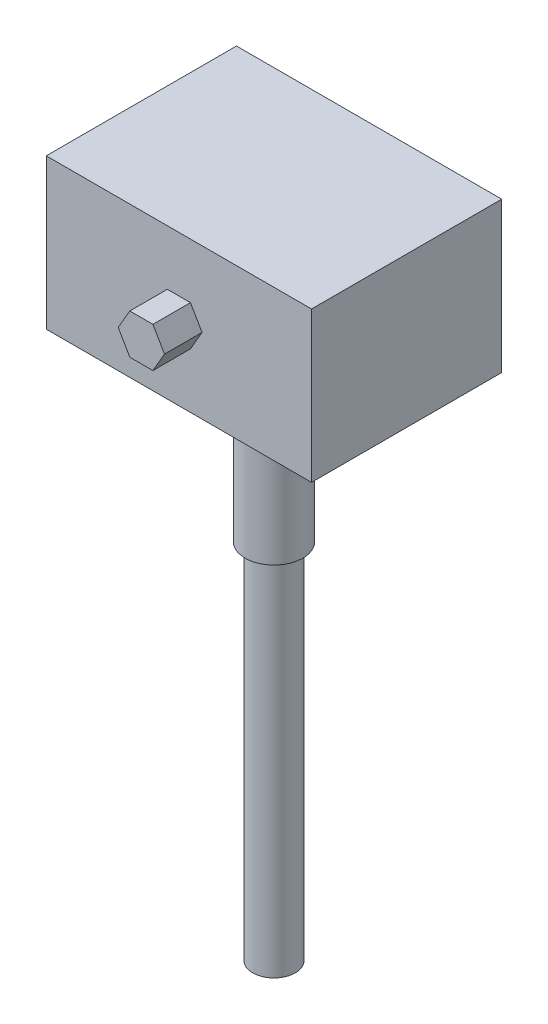
ISO-10303-21;
HEADER;
FILE_DESCRIPTION(('STEP AP214'),'2;1');
FILE_NAME('part.step','',(''),(''),'','','');
FILE_SCHEMA(('AUTOMOTIVE_DESIGN { 1 0 10303 214 1 1 1 1 }'));
ENDSEC;
DATA;
#1=APPLICATION_CONTEXT('core data for automotive mechanical design processes');
#2=APPLICATION_PROTOCOL_DEFINITION('international standard','automotive_design',2000,#1);
#3=PRODUCT_CONTEXT('',#1,'mechanical');
#4=PRODUCT('Part','Part','',(#3));
#5=PRODUCT_RELATED_PRODUCT_CATEGORY('part','',(#4));
#6=PRODUCT_DEFINITION_FORMATION('','',#4);
#7=PRODUCT_DEFINITION_CONTEXT('part definition',#1,'design');
#8=PRODUCT_DEFINITION('design','',#6,#7);
#9=PRODUCT_DEFINITION_SHAPE('','',#8);
#10=(LENGTH_UNIT() NAMED_UNIT(*) SI_UNIT(.MILLI.,.METRE.));
#11=(NAMED_UNIT(*) PLANE_ANGLE_UNIT() SI_UNIT($,.RADIAN.));
#12=(NAMED_UNIT(*) SI_UNIT($,.STERADIAN.) SOLID_ANGLE_UNIT());
#13=UNCERTAINTY_MEASURE_WITH_UNIT(LENGTH_MEASURE(1.E-05),#10,'distance_accuracy_value','');
#14=(GEOMETRIC_REPRESENTATION_CONTEXT(3) GLOBAL_UNCERTAINTY_ASSIGNED_CONTEXT((#13)) GLOBAL_UNIT_ASSIGNED_CONTEXT((#10,
#11,#12)) REPRESENTATION_CONTEXT('',''));
#15=CARTESIAN_POINT('',(0.,0.,0.));
#16=DIRECTION('',(0.,0.,1.));
#17=DIRECTION('',(1.,0.,0.));
#18=AXIS2_PLACEMENT_3D('',#15,#16,#17);
#19=CARTESIAN_POINT('',(-53.,60.,38.));
#20=DIRECTION('',(0.,0.,-1.));
#21=DIRECTION('',(-1.,0.,0.));
#22=AXIS2_PLACEMENT_3D('',#19,#20,#21);
#23=PLANE('',#22);
#24=DIRECTION('',(1.,0.,0.));
#25=VECTOR('',#24,1.);
#26=CARTESIAN_POINT('',(-53.,0.,38.));
#27=LINE('',#26,#25);
#28=CARTESIAN_POINT('',(-53.,0.,38.));
#29=VERTEX_POINT('',#28);
#30=CARTESIAN_POINT('',(53.,0.,38.));
#31=VERTEX_POINT('',#30);
#32=EDGE_CURVE('E146',#29,#31,#27,.T.);
#33=ORIENTED_EDGE('',*,*,#32,.T.);
#34=DIRECTION('',(0.,-1.,0.));
#35=VECTOR('',#34,1.);
#36=CARTESIAN_POINT('',(53.,60.,38.));
#37=LINE('',#36,#35);
#38=CARTESIAN_POINT('',(53.,60.,38.));
#39=VERTEX_POINT('',#38);
#40=EDGE_CURVE('E151',#39,#31,#37,.T.);
#41=ORIENTED_EDGE('',*,*,#40,.F.);
#42=DIRECTION('',(1.,0.,0.));
#43=VECTOR('',#42,1.);
#44=CARTESIAN_POINT('',(-53.,60.,38.));
#45=LINE('',#44,#43);
#46=CARTESIAN_POINT('',(-53.,60.,38.));
#47=VERTEX_POINT('',#46);
#48=EDGE_CURVE('E150',#47,#39,#45,.T.);
#49=ORIENTED_EDGE('',*,*,#48,.F.);
#50=DIRECTION('',(0.,-1.,0.));
#51=VECTOR('',#50,1.);
#52=CARTESIAN_POINT('',(-53.,60.,38.));
#53=LINE('',#52,#51);
#54=EDGE_CURVE('E159',#47,#29,#53,.T.);
#55=ORIENTED_EDGE('',*,*,#54,.T.);
#56=EDGE_LOOP('',(#33,#41,#49,#55));
#57=FACE_BOUND('',#56,.T.);
#58=DIRECTION('',(0.499999999999999,0.866025403784439,0.));
#59=VECTOR('',#58,1.);
#60=CARTESIAN_POINT('',(4.618802153517,22.,38.));
#61=LINE('',#60,#59);
#62=CARTESIAN_POINT('',(4.618802153517,22.,38.));
#63=VERTEX_POINT('',#62);
#64=CARTESIAN_POINT('',(9.23760430703401,30.,38.));
#65=VERTEX_POINT('',#64);
#66=EDGE_CURVE('E132',#63,#65,#61,.T.);
#67=ORIENTED_EDGE('',*,*,#66,.F.);
#68=DIRECTION('',(1.,0.,0.));
#69=VECTOR('',#68,1.);
#70=CARTESIAN_POINT('',(-4.618802153517,22.,38.));
#71=LINE('',#70,#69);
#72=CARTESIAN_POINT('',(-4.618802153517,22.,38.));
#73=VERTEX_POINT('',#72);
#74=EDGE_CURVE('E129',#73,#63,#71,.T.);
#75=ORIENTED_EDGE('',*,*,#74,.F.);
#76=DIRECTION('',(0.500000000000001,-0.866025403784438,0.));
#77=VECTOR('',#76,1.);
#78=CARTESIAN_POINT('',(-9.23760430703402,30.,38.));
#79=LINE('',#78,#77);
#80=CARTESIAN_POINT('',(-9.23760430703402,30.,38.));
#81=VERTEX_POINT('',#80);
#82=EDGE_CURVE('E193',#81,#73,#79,.T.);
#83=ORIENTED_EDGE('',*,*,#82,.F.);
#84=DIRECTION('',(-0.499999999999999,-0.866025403784439,0.));
#85=VECTOR('',#84,1.);
#86=CARTESIAN_POINT('',(-4.61880215351701,38.,38.));
#87=LINE('',#86,#85);
#88=CARTESIAN_POINT('',(-4.618802153517,38.,38.));
#89=VERTEX_POINT('',#88);
#90=EDGE_CURVE('E190',#89,#81,#87,.T.);
#91=ORIENTED_EDGE('',*,*,#90,.F.);
#92=DIRECTION('',(-1.,0.,0.));
#93=VECTOR('',#92,1.);
#94=CARTESIAN_POINT('',(4.618802153517,38.,38.));
#95=LINE('',#94,#93);
#96=CARTESIAN_POINT('',(4.618802153517,38.,38.));
#97=VERTEX_POINT('',#96);
#98=EDGE_CURVE('E55',#97,#89,#95,.T.);
#99=ORIENTED_EDGE('',*,*,#98,.F.);
#100=DIRECTION('',(-0.5,0.866025403784439,0.));
#101=VECTOR('',#100,1.);
#102=CARTESIAN_POINT('',(9.237604307034,30.,38.));
#103=LINE('',#102,#101);
#104=EDGE_CURVE('E50',#65,#97,#103,.T.);
#105=ORIENTED_EDGE('',*,*,#104,.F.);
#106=EDGE_LOOP('',(#67,#75,#83,#91,#99,#105));
#107=FACE_BOUND('',#106,.T.);
#108=ADVANCED_FACE('F33',(#57,#107),#23,.F.);
#109=CARTESIAN_POINT('',(53.,60.,-38.));
#110=DIRECTION('',(-1.,0.,0.));
#111=DIRECTION('',(0.,0.,1.));
#112=AXIS2_PLACEMENT_3D('',#109,#110,#111);
#113=PLANE('',#112);
#114=DIRECTION('',(0.,0.,-1.));
#115=VECTOR('',#114,1.);
#116=CARTESIAN_POINT('',(53.,0.,-38.));
#117=LINE('',#116,#115);
#118=CARTESIAN_POINT('',(53.,0.,-38.));
#119=VERTEX_POINT('',#118);
#120=EDGE_CURVE('E133',#31,#119,#117,.T.);
#121=ORIENTED_EDGE('',*,*,#120,.T.);
#122=DIRECTION('',(0.,-1.,0.));
#123=VECTOR('',#122,1.);
#124=CARTESIAN_POINT('',(53.,60.,-38.));
#125=LINE('',#124,#123);
#126=CARTESIAN_POINT('',(53.,60.,-38.));
#127=VERTEX_POINT('',#126);
#128=EDGE_CURVE('E37',#127,#119,#125,.T.);
#129=ORIENTED_EDGE('',*,*,#128,.F.);
#130=DIRECTION('',(0.,0.,-1.));
#131=VECTOR('',#130,1.);
#132=CARTESIAN_POINT('',(53.,60.,-38.));
#133=LINE('',#132,#131);
#134=EDGE_CURVE('E142',#39,#127,#133,.T.);
#135=ORIENTED_EDGE('',*,*,#134,.F.);
#136=ORIENTED_EDGE('',*,*,#40,.T.);
#137=EDGE_LOOP('',(#121,#129,#135,#136));
#138=FACE_BOUND('',#137,.T.);
#139=ADVANCED_FACE('F35',(#138),#113,.F.);
#140=CARTESIAN_POINT('',(-53.,60.,-38.));
#141=DIRECTION('',(0.,0.,1.));
#142=DIRECTION('',(1.,0.,0.));
#143=AXIS2_PLACEMENT_3D('',#140,#141,#142);
#144=PLANE('',#143);
#145=DIRECTION('',(-1.,0.,0.));
#146=VECTOR('',#145,1.);
#147=CARTESIAN_POINT('',(-53.,0.,-38.));
#148=LINE('',#147,#146);
#149=CARTESIAN_POINT('',(-53.,0.,-38.));
#150=VERTEX_POINT('',#149);
#151=EDGE_CURVE('E136',#119,#150,#148,.T.);
#152=ORIENTED_EDGE('',*,*,#151,.T.);
#153=DIRECTION('',(0.,-1.,0.));
#154=VECTOR('',#153,1.);
#155=CARTESIAN_POINT('',(-53.,60.,-38.));
#156=LINE('',#155,#154);
#157=CARTESIAN_POINT('',(-53.,60.,-38.));
#158=VERTEX_POINT('',#157);
#159=EDGE_CURVE('E161',#158,#150,#156,.T.);
#160=ORIENTED_EDGE('',*,*,#159,.F.);
#161=DIRECTION('',(-1.,0.,0.));
#162=VECTOR('',#161,1.);
#163=CARTESIAN_POINT('',(-53.,60.,-38.));
#164=LINE('',#163,#162);
#165=EDGE_CURVE('E145',#127,#158,#164,.T.);
#166=ORIENTED_EDGE('',*,*,#165,.F.);
#167=ORIENTED_EDGE('',*,*,#128,.T.);
#168=EDGE_LOOP('',(#152,#160,#166,#167));
#169=FACE_BOUND('',#168,.T.);
#170=ADVANCED_FACE('F224',(#169),#144,.F.);
#171=CARTESIAN_POINT('',(-53.,60.,-38.));
#172=DIRECTION('',(1.,0.,0.));
#173=DIRECTION('',(0.,0.,-1.));
#174=AXIS2_PLACEMENT_3D('',#171,#172,#173);
#175=PLANE('',#174);
#176=DIRECTION('',(0.,0.,1.));
#177=VECTOR('',#176,1.);
#178=CARTESIAN_POINT('',(-53.,0.,-38.));
#179=LINE('',#178,#177);
#180=EDGE_CURVE('E154',#150,#29,#179,.T.);
#181=ORIENTED_EDGE('',*,*,#180,.T.);
#182=ORIENTED_EDGE('',*,*,#54,.F.);
#183=DIRECTION('',(0.,0.,1.));
#184=VECTOR('',#183,1.);
#185=CARTESIAN_POINT('',(-53.,60.,-38.));
#186=LINE('',#185,#184);
#187=EDGE_CURVE('E148',#158,#47,#186,.T.);
#188=ORIENTED_EDGE('',*,*,#187,.F.);
#189=ORIENTED_EDGE('',*,*,#159,.T.);
#190=EDGE_LOOP('',(#181,#182,#188,#189));
#191=FACE_BOUND('',#190,.T.);
#192=ADVANCED_FACE('F230',(#191),#175,.F.);
#193=CARTESIAN_POINT('',(0.,60.,0.));
#194=DIRECTION('',(0.,1.,0.));
#195=DIRECTION('',(0.,0.,1.));
#196=AXIS2_PLACEMENT_3D('',#193,#194,#195);
#197=PLANE('',#196);
#198=ORIENTED_EDGE('',*,*,#134,.T.);
#199=ORIENTED_EDGE('',*,*,#165,.T.);
#200=ORIENTED_EDGE('',*,*,#187,.T.);
#201=ORIENTED_EDGE('',*,*,#48,.T.);
#202=EDGE_LOOP('',(#198,#199,#200,#201));
#203=FACE_BOUND('',#202,.T.);
#204=ADVANCED_FACE('F232',(#203),#197,.T.);
#205=CARTESIAN_POINT('',(0.,0.,0.));
#206=DIRECTION('',(0.,1.,0.));
#207=DIRECTION('',(0.,0.,1.));
#208=AXIS2_PLACEMENT_3D('',#205,#206,#207);
#209=PLANE('',#208);
#210=CARTESIAN_POINT('',(0.,0.,0.));
#211=DIRECTION('',(0.,-1.,0.));
#212=DIRECTION('',(0.,0.,-1.));
#213=AXIS2_PLACEMENT_3D('',#210,#211,#212);
#214=CIRCLE('',#213,14.);
#215=CARTESIAN_POINT('',(0.,0.,-14.));
#216=VERTEX_POINT('',#215);
#217=EDGE_CURVE('E168',#216,#216,#214,.T.);
#218=ORIENTED_EDGE('',*,*,#217,.F.);
#219=EDGE_LOOP('',(#218));
#220=FACE_BOUND('',#219,.T.);
#221=ORIENTED_EDGE('',*,*,#120,.F.);
#222=ORIENTED_EDGE('',*,*,#32,.F.);
#223=ORIENTED_EDGE('',*,*,#180,.F.);
#224=ORIENTED_EDGE('',*,*,#151,.F.);
#225=EDGE_LOOP('',(#221,#222,#223,#224));
#226=FACE_BOUND('',#225,.T.);
#227=ADVANCED_FACE('F228',(#220,#226),#209,.F.);
#228=CARTESIAN_POINT('',(4.618802153517,22.,53.));
#229=DIRECTION('',(-0.866025403784439,0.499999999999999,0.));
#230=DIRECTION('',(-0.499999999999999,-0.866025403784439,0.));
#231=AXIS2_PLACEMENT_3D('',#228,#229,#230);
#232=PLANE('',#231);
#233=ORIENTED_EDGE('',*,*,#66,.T.);
#234=DIRECTION('',(0.,0.,-1.));
#235=VECTOR('',#234,1.);
#236=CARTESIAN_POINT('',(9.237604307034,30.,53.));
#237=LINE('',#236,#235);
#238=CARTESIAN_POINT('',(9.237604307034,30.,53.));
#239=VERTEX_POINT('',#238);
#240=EDGE_CURVE('E113',#239,#65,#237,.T.);
#241=ORIENTED_EDGE('',*,*,#240,.F.);
#242=DIRECTION('',(0.499999999999999,0.866025403784439,0.));
#243=VECTOR('',#242,1.);
#244=CARTESIAN_POINT('',(4.618802153517,22.,53.));
#245=LINE('',#244,#243);
#246=CARTESIAN_POINT('',(4.618802153517,22.,53.));
#247=VERTEX_POINT('',#246);
#248=EDGE_CURVE('E120',#247,#239,#245,.T.);
#249=ORIENTED_EDGE('',*,*,#248,.F.);
#250=DIRECTION('',(0.,0.,-1.));
#251=VECTOR('',#250,1.);
#252=CARTESIAN_POINT('',(4.618802153517,22.,53.));
#253=LINE('',#252,#251);
#254=EDGE_CURVE('E186',#247,#63,#253,.T.);
#255=ORIENTED_EDGE('',*,*,#254,.T.);
#256=EDGE_LOOP('',(#233,#241,#249,#255));
#257=FACE_BOUND('',#256,.T.);
#258=ADVANCED_FACE('F131',(#257),#232,.F.);
#259=CARTESIAN_POINT('',(9.237604307034,30.,53.));
#260=DIRECTION('',(-0.866025403784439,-0.5,0.));
#261=DIRECTION('',(0.5,-0.866025403784439,0.));
#262=AXIS2_PLACEMENT_3D('',#259,#260,#261);
#263=PLANE('',#262);
#264=ORIENTED_EDGE('',*,*,#104,.T.);
#265=DIRECTION('',(0.,0.,-1.));
#266=VECTOR('',#265,1.);
#267=CARTESIAN_POINT('',(4.618802153517,38.,53.));
#268=LINE('',#267,#266);
#269=CARTESIAN_POINT('',(4.618802153517,38.,53.));
#270=VERTEX_POINT('',#269);
#271=EDGE_CURVE('E116',#270,#97,#268,.T.);
#272=ORIENTED_EDGE('',*,*,#271,.F.);
#273=DIRECTION('',(-0.5,0.866025403784439,0.));
#274=VECTOR('',#273,1.);
#275=CARTESIAN_POINT('',(9.237604307034,30.,53.));
#276=LINE('',#275,#274);
#277=EDGE_CURVE('E109',#239,#270,#276,.T.);
#278=ORIENTED_EDGE('',*,*,#277,.F.);
#279=ORIENTED_EDGE('',*,*,#240,.T.);
#280=EDGE_LOOP('',(#264,#272,#278,#279));
#281=FACE_BOUND('',#280,.T.);
#282=ADVANCED_FACE('F111',(#281),#263,.F.);
#283=CARTESIAN_POINT('',(4.618802153517,38.,53.));
#284=DIRECTION('',(0.,-1.,0.));
#285=DIRECTION('',(0.,0.,-1.));
#286=AXIS2_PLACEMENT_3D('',#283,#284,#285);
#287=PLANE('',#286);
#288=ORIENTED_EDGE('',*,*,#98,.T.);
#289=DIRECTION('',(0.,0.,-1.));
#290=VECTOR('',#289,1.);
#291=CARTESIAN_POINT('',(-4.61880215351701,38.,53.));
#292=LINE('',#291,#290);
#293=CARTESIAN_POINT('',(-4.61880215351701,38.,53.));
#294=VERTEX_POINT('',#293);
#295=EDGE_CURVE('E138',#294,#89,#292,.T.);
#296=ORIENTED_EDGE('',*,*,#295,.F.);
#297=DIRECTION('',(-1.,0.,0.));
#298=VECTOR('',#297,1.);
#299=CARTESIAN_POINT('',(4.618802153517,38.,53.));
#300=LINE('',#299,#298);
#301=EDGE_CURVE('E119',#270,#294,#300,.T.);
#302=ORIENTED_EDGE('',*,*,#301,.F.);
#303=ORIENTED_EDGE('',*,*,#271,.T.);
#304=EDGE_LOOP('',(#288,#296,#302,#303));
#305=FACE_BOUND('',#304,.T.);
#306=ADVANCED_FACE('F211',(#305),#287,.F.);
#307=CARTESIAN_POINT('',(-4.61880215351701,38.,53.));
#308=DIRECTION('',(0.866025403784439,-0.499999999999999,0.));
#309=DIRECTION('',(0.499999999999999,0.866025403784439,0.));
#310=AXIS2_PLACEMENT_3D('',#307,#308,#309);
#311=PLANE('',#310);
#312=ORIENTED_EDGE('',*,*,#90,.T.);
#313=DIRECTION('',(0.,0.,-1.));
#314=VECTOR('',#313,1.);
#315=CARTESIAN_POINT('',(-9.23760430703402,30.,53.));
#316=LINE('',#315,#314);
#317=CARTESIAN_POINT('',(-9.23760430703402,30.,53.));
#318=VERTEX_POINT('',#317);
#319=EDGE_CURVE('E202',#318,#81,#316,.T.);
#320=ORIENTED_EDGE('',*,*,#319,.F.);
#321=DIRECTION('',(-0.499999999999999,-0.866025403784439,0.));
#322=VECTOR('',#321,1.);
#323=CARTESIAN_POINT('',(-4.61880215351701,38.,53.));
#324=LINE('',#323,#322);
#325=EDGE_CURVE('E181',#294,#318,#324,.T.);
#326=ORIENTED_EDGE('',*,*,#325,.F.);
#327=ORIENTED_EDGE('',*,*,#295,.T.);
#328=EDGE_LOOP('',(#312,#320,#326,#327));
#329=FACE_BOUND('',#328,.T.);
#330=ADVANCED_FACE('F208',(#329),#311,.F.);
#331=CARTESIAN_POINT('',(-9.23760430703402,30.,53.));
#332=DIRECTION('',(0.866025403784438,0.500000000000001,0.));
#333=DIRECTION('',(-0.500000000000001,0.866025403784438,0.));
#334=AXIS2_PLACEMENT_3D('',#331,#332,#333);
#335=PLANE('',#334);
#336=ORIENTED_EDGE('',*,*,#82,.T.);
#337=DIRECTION('',(0.,0.,-1.));
#338=VECTOR('',#337,1.);
#339=CARTESIAN_POINT('',(-4.618802153517,22.,53.));
#340=LINE('',#339,#338);
#341=CARTESIAN_POINT('',(-4.618802153517,22.,53.));
#342=VERTEX_POINT('',#341);
#343=EDGE_CURVE('E199',#342,#73,#340,.T.);
#344=ORIENTED_EDGE('',*,*,#343,.F.);
#345=DIRECTION('',(0.500000000000001,-0.866025403784438,0.));
#346=VECTOR('',#345,1.);
#347=CARTESIAN_POINT('',(-9.23760430703402,30.,53.));
#348=LINE('',#347,#346);
#349=EDGE_CURVE('E183',#318,#342,#348,.T.);
#350=ORIENTED_EDGE('',*,*,#349,.F.);
#351=ORIENTED_EDGE('',*,*,#319,.T.);
#352=EDGE_LOOP('',(#336,#344,#350,#351));
#353=FACE_BOUND('',#352,.T.);
#354=ADVANCED_FACE('F215',(#353),#335,.F.);
#355=CARTESIAN_POINT('',(-4.618802153517,22.,53.));
#356=DIRECTION('',(0.,1.,0.));
#357=DIRECTION('',(-1.,0.,0.));
#358=AXIS2_PLACEMENT_3D('',#355,#356,#357);
#359=PLANE('',#358);
#360=ORIENTED_EDGE('',*,*,#74,.T.);
#361=ORIENTED_EDGE('',*,*,#254,.F.);
#362=DIRECTION('',(1.,0.,0.));
#363=VECTOR('',#362,1.);
#364=CARTESIAN_POINT('',(-4.618802153517,22.,53.));
#365=LINE('',#364,#363);
#366=EDGE_CURVE('E125',#342,#247,#365,.T.);
#367=ORIENTED_EDGE('',*,*,#366,.F.);
#368=ORIENTED_EDGE('',*,*,#343,.T.);
#369=EDGE_LOOP('',(#360,#361,#367,#368));
#370=FACE_BOUND('',#369,.T.);
#371=ADVANCED_FACE('F217',(#370),#359,.F.);
#372=CARTESIAN_POINT('',(0.,0.,53.));
#373=DIRECTION('',(0.,0.,1.));
#374=DIRECTION('',(1.,0.,0.));
#375=AXIS2_PLACEMENT_3D('',#372,#373,#374);
#376=PLANE('',#375);
#377=ORIENTED_EDGE('',*,*,#248,.T.);
#378=ORIENTED_EDGE('',*,*,#277,.T.);
#379=ORIENTED_EDGE('',*,*,#301,.T.);
#380=ORIENTED_EDGE('',*,*,#325,.T.);
#381=ORIENTED_EDGE('',*,*,#349,.T.);
#382=ORIENTED_EDGE('',*,*,#366,.T.);
#383=EDGE_LOOP('',(#377,#378,#379,#380,#381,#382));
#384=FACE_BOUND('',#383,.T.);
#385=ADVANCED_FACE('F123',(#384),#376,.T.);
#386=CARTESIAN_POINT('',(0.,-15.,0.));
#387=DIRECTION('',(0.,1.,0.));
#388=DIRECTION('',(0.,0.,1.));
#389=AXIS2_PLACEMENT_3D('',#386,#387,#388);
#390=CYLINDRICAL_SURFACE('',#389,14.);
#391=CARTESIAN_POINT('',(0.,-15.,0.));
#392=DIRECTION('',(0.,-1.,0.));
#393=DIRECTION('',(0.,0.,-1.));
#394=AXIS2_PLACEMENT_3D('',#391,#392,#393);
#395=CIRCLE('',#394,14.);
#396=CARTESIAN_POINT('',(0.,-15.,-14.));
#397=VERTEX_POINT('',#396);
#398=EDGE_CURVE('E178',#397,#397,#395,.T.);
#399=ORIENTED_EDGE('',*,*,#398,.F.);
#400=EDGE_LOOP('',(#399));
#401=FACE_BOUND('',#400,.T.);
#402=ORIENTED_EDGE('',*,*,#217,.T.);
#403=EDGE_LOOP('',(#402));
#404=FACE_BOUND('',#403,.T.);
#405=ADVANCED_FACE('F264',(#401,#404),#390,.T.);
#406=CARTESIAN_POINT('',(0.,-15.,0.));
#407=DIRECTION('',(0.,-1.,0.));
#408=DIRECTION('',(0.,0.,-1.));
#409=AXIS2_PLACEMENT_3D('',#406,#407,#408);
#410=PLANE('',#409);
#411=CARTESIAN_POINT('',(0.,-15.,0.));
#412=DIRECTION('',(0.,-1.,0.));
#413=DIRECTION('',(0.,0.,-1.));
#414=AXIS2_PLACEMENT_3D('',#411,#412,#413);
#415=CIRCLE('',#414,5.);
#416=CARTESIAN_POINT('',(0.,-15.,-5.));
#417=VERTEX_POINT('',#416);
#418=EDGE_CURVE('E42',#417,#417,#415,.T.);
#419=ORIENTED_EDGE('',*,*,#418,.F.);
#420=EDGE_LOOP('',(#419));
#421=FACE_BOUND('',#420,.T.);
#422=ORIENTED_EDGE('',*,*,#398,.T.);
#423=EDGE_LOOP('',(#422));
#424=FACE_BOUND('',#423,.T.);
#425=ADVANCED_FACE('F267',(#421,#424),#410,.T.);
#426=CARTESIAN_POINT('',(0.,-26.,0.));
#427=DIRECTION('',(0.,1.,0.));
#428=DIRECTION('',(0.,0.,1.));
#429=AXIS2_PLACEMENT_3D('',#426,#427,#428);
#430=CYLINDRICAL_SURFACE('',#429,5.);
#431=CARTESIAN_POINT('',(0.,-26.,0.));
#432=DIRECTION('',(0.,-1.,0.));
#433=DIRECTION('',(0.,0.,-1.));
#434=AXIS2_PLACEMENT_3D('',#431,#432,#433);
#435=CIRCLE('',#434,5.);
#436=CARTESIAN_POINT('',(0.,-26.,-5.));
#437=VERTEX_POINT('',#436);
#438=EDGE_CURVE('E307',#437,#437,#435,.T.);
#439=ORIENTED_EDGE('',*,*,#438,.F.);
#440=EDGE_LOOP('',(#439));
#441=FACE_BOUND('',#440,.T.);
#442=ORIENTED_EDGE('',*,*,#418,.T.);
#443=EDGE_LOOP('',(#442));
#444=FACE_BOUND('',#443,.T.);
#445=ADVANCED_FACE('F271',(#441,#444),#430,.T.);
#446=CARTESIAN_POINT('',(0.,-66.,0.));
#447=DIRECTION('',(0.,1.,0.));
#448=DIRECTION('',(0.,0.,1.));
#449=AXIS2_PLACEMENT_3D('',#446,#447,#448);
#450=CYLINDRICAL_SURFACE('',#449,11.5);
#451=CARTESIAN_POINT('',(0.,-66.,0.));
#452=DIRECTION('',(0.,-1.,0.));
#453=DIRECTION('',(0.,0.,-1.));
#454=AXIS2_PLACEMENT_3D('',#451,#452,#453);
#455=CIRCLE('',#454,11.5);
#456=CARTESIAN_POINT('',(0.,-66.,-11.5));
#457=VERTEX_POINT('',#456);
#458=EDGE_CURVE('E303',#457,#457,#455,.T.);
#459=ORIENTED_EDGE('',*,*,#458,.F.);
#460=EDGE_LOOP('',(#459));
#461=FACE_BOUND('',#460,.T.);
#462=CARTESIAN_POINT('',(0.,-26.,0.));
#463=DIRECTION('',(0.,-1.,0.));
#464=DIRECTION('',(0.,0.,-1.));
#465=AXIS2_PLACEMENT_3D('',#462,#463,#464);
#466=CIRCLE('',#465,11.5);
#467=CARTESIAN_POINT('',(0.,-26.,-11.5));
#468=VERTEX_POINT('',#467);
#469=EDGE_CURVE('E300',#468,#468,#466,.T.);
#470=ORIENTED_EDGE('',*,*,#469,.T.);
#471=EDGE_LOOP('',(#470));
#472=FACE_BOUND('',#471,.T.);
#473=ADVANCED_FACE('F275',(#461,#472),#450,.T.);
#474=CARTESIAN_POINT('',(0.,-66.,0.));
#475=DIRECTION('',(0.,-1.,0.));
#476=DIRECTION('',(0.,0.,-1.));
#477=AXIS2_PLACEMENT_3D('',#474,#475,#476);
#478=PLANE('',#477);
#479=CARTESIAN_POINT('',(0.,-66.,0.));
#480=DIRECTION('',(0.,-1.,0.));
#481=DIRECTION('',(0.,0.,-1.));
#482=AXIS2_PLACEMENT_3D('',#479,#480,#481);
#483=CIRCLE('',#482,8.5);
#484=CARTESIAN_POINT('',(0.,-66.,-8.5));
#485=VERTEX_POINT('',#484);
#486=EDGE_CURVE('E11',#485,#485,#483,.T.);
#487=ORIENTED_EDGE('',*,*,#486,.F.);
#488=EDGE_LOOP('',(#487));
#489=FACE_BOUND('',#488,.T.);
#490=ORIENTED_EDGE('',*,*,#458,.T.);
#491=EDGE_LOOP('',(#490));
#492=FACE_BOUND('',#491,.T.);
#493=ADVANCED_FACE('F279',(#489,#492),#478,.T.);
#494=CARTESIAN_POINT('',(0.,-26.,0.));
#495=DIRECTION('',(0.,-1.,0.));
#496=DIRECTION('',(0.,0.,-1.));
#497=AXIS2_PLACEMENT_3D('',#494,#495,#496);
#498=PLANE('',#497);
#499=ORIENTED_EDGE('',*,*,#438,.T.);
#500=EDGE_LOOP('',(#499));
#501=FACE_BOUND('',#500,.T.);
#502=ORIENTED_EDGE('',*,*,#469,.F.);
#503=EDGE_LOOP('',(#502));
#504=FACE_BOUND('',#503,.T.);
#505=ADVANCED_FACE('F281',(#501,#504),#498,.F.);
#506=CARTESIAN_POINT('',(0.,-211.,0.));
#507=DIRECTION('',(0.,1.,0.));
#508=DIRECTION('',(0.,0.,1.));
#509=AXIS2_PLACEMENT_3D('',#506,#507,#508);
#510=CYLINDRICAL_SURFACE('',#509,8.5);
#511=CARTESIAN_POINT('',(0.,-211.,0.));
#512=DIRECTION('',(0.,-1.,0.));
#513=DIRECTION('',(0.,0.,-1.));
#514=AXIS2_PLACEMENT_3D('',#511,#512,#513);
#515=CIRCLE('',#514,8.5);
#516=CARTESIAN_POINT('',(0.,-211.,-8.5));
#517=VERTEX_POINT('',#516);
#518=EDGE_CURVE('E299',#517,#517,#515,.T.);
#519=ORIENTED_EDGE('',*,*,#518,.F.);
#520=EDGE_LOOP('',(#519));
#521=FACE_BOUND('',#520,.T.);
#522=ORIENTED_EDGE('',*,*,#486,.T.);
#523=EDGE_LOOP('',(#522));
#524=FACE_BOUND('',#523,.T.);
#525=ADVANCED_FACE('F284',(#521,#524),#510,.T.);
#526=CARTESIAN_POINT('',(0.,-211.,0.));
#527=DIRECTION('',(0.,-1.,0.));
#528=DIRECTION('',(0.,0.,-1.));
#529=AXIS2_PLACEMENT_3D('',#526,#527,#528);
#530=PLANE('',#529);
#531=ORIENTED_EDGE('',*,*,#518,.T.);
#532=EDGE_LOOP('',(#531));
#533=FACE_BOUND('',#532,.T.);
#534=ADVANCED_FACE('F291',(#533),#530,.T.);
#535=CLOSED_SHELL('',(#108,#139,#170,#192,#204,#227,#258,#282,#306,#330,#354,#371,#385,#405,
#425,#445,#473,#493,#505,#525,#534));
#536=MANIFOLD_SOLID_BREP('B2',#535);
#537=ADVANCED_BREP_SHAPE_REPRESENTATION('',(#18,#536),#14);
#538=SHAPE_DEFINITION_REPRESENTATION(#9,#537);
ENDSEC;
END-ISO-10303-21;
